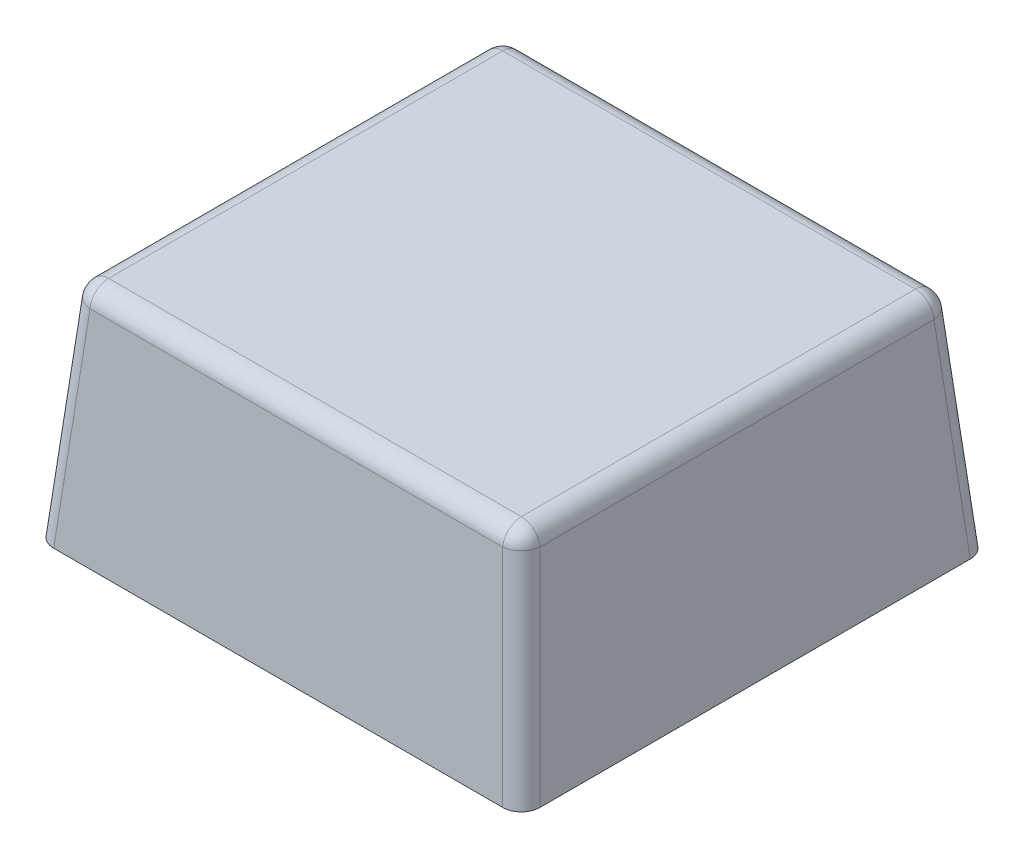
ISO-10303-21;
HEADER;
FILE_DESCRIPTION(('STEP AP214'),'2;1');
FILE_NAME('part.step','',(''),(''),'','','');
FILE_SCHEMA(('AUTOMOTIVE_DESIGN { 1 0 10303 214 1 1 1 1 }'));
ENDSEC;
DATA;
#1=APPLICATION_CONTEXT('core data for automotive mechanical design processes');
#2=APPLICATION_PROTOCOL_DEFINITION('international standard','automotive_design',2000,#1);
#3=PRODUCT_CONTEXT('',#1,'mechanical');
#4=PRODUCT('Part','Part','',(#3));
#5=PRODUCT_RELATED_PRODUCT_CATEGORY('part','',(#4));
#6=PRODUCT_DEFINITION_FORMATION('','',#4);
#7=PRODUCT_DEFINITION_CONTEXT('part definition',#1,'design');
#8=PRODUCT_DEFINITION('design','',#6,#7);
#9=PRODUCT_DEFINITION_SHAPE('','',#8);
#10=(LENGTH_UNIT() NAMED_UNIT(*) SI_UNIT(.MILLI.,.METRE.));
#11=(NAMED_UNIT(*) PLANE_ANGLE_UNIT() SI_UNIT($,.RADIAN.));
#12=(NAMED_UNIT(*) SI_UNIT($,.STERADIAN.) SOLID_ANGLE_UNIT());
#13=UNCERTAINTY_MEASURE_WITH_UNIT(LENGTH_MEASURE(1.E-05),#10,'distance_accuracy_value','');
#14=(GEOMETRIC_REPRESENTATION_CONTEXT(3) GLOBAL_UNCERTAINTY_ASSIGNED_CONTEXT((#13)) GLOBAL_UNIT_ASSIGNED_CONTEXT((#10,
#11,#12)) REPRESENTATION_CONTEXT('',''));
#15=CARTESIAN_POINT('',(0.,0.,0.));
#16=DIRECTION('',(0.,0.,1.));
#17=DIRECTION('',(1.,0.,0.));
#18=AXIS2_PLACEMENT_3D('',#15,#16,#17);
#19=CARTESIAN_POINT('',(0.,0.85,-0.526690243184));
#20=DIRECTION('',(-1.,0.,0.));
#21=DIRECTION('',(0.,0.,1.));
#22=AXIS2_PLACEMENT_3D('',#19,#20,#21);
#23=CYLINDRICAL_SURFACE('',#22,0.05);
#24=CARTESIAN_POINT('',(0.551690243184,0.85,-0.526690243184));
#25=DIRECTION('',(-1.,0.,0.));
#26=DIRECTION('',(0.,0.,-1.));
#27=AXIS2_PLACEMENT_3D('',#24,#25,#26);
#28=CIRCLE('',#27,0.05);
#29=CARTESIAN_POINT('',(0.551690243184,0.9,-0.526690243184));
#30=VERTEX_POINT('',#29);
#31=CARTESIAN_POINT('',(0.551690243184,0.854357787137,-0.576499978088));
#32=VERTEX_POINT('',#31);
#33=EDGE_CURVE('E25',#30,#32,#28,.T.);
#34=ORIENTED_EDGE('',*,*,#33,.T.);
#35=DIRECTION('',(1.,0.,0.));
#36=VECTOR('',#35,1.);
#37=CARTESIAN_POINT('',(0.597506801884,0.854357787137,-0.576499978088));
#38=LINE('',#37,#36);
#39=CARTESIAN_POINT('',(-0.551690243184,0.854357787137,-0.576499978088));
#40=VERTEX_POINT('',#39);
#41=EDGE_CURVE('E166',#40,#32,#38,.T.);
#42=ORIENTED_EDGE('',*,*,#41,.F.);
#43=CARTESIAN_POINT('',(-0.551690243184,0.85,-0.526690243184));
#44=DIRECTION('',(1.,0.,0.));
#45=DIRECTION('',(0.,0.,1.));
#46=AXIS2_PLACEMENT_3D('',#43,#44,#45);
#47=CIRCLE('',#46,0.05);
#48=CARTESIAN_POINT('',(-0.551690243184,0.9,-0.526690243184));
#49=VERTEX_POINT('',#48);
#50=EDGE_CURVE('E11',#40,#49,#47,.T.);
#51=ORIENTED_EDGE('',*,*,#50,.T.);
#52=DIRECTION('',(-1.,0.,0.));
#53=VECTOR('',#52,1.);
#54=CARTESIAN_POINT('',(-0.597506801884,0.9,-0.526690243184));
#55=LINE('',#54,#53);
#56=EDGE_CURVE('E214',#30,#49,#55,.T.);
#57=ORIENTED_EDGE('',*,*,#56,.F.);
#58=EDGE_LOOP('',(#34,#42,#51,#57));
#59=FACE_BOUND('',#58,.T.);
#60=ADVANCED_FACE('F17',(#59),#23,.T.);
#61=CARTESIAN_POINT('',(-0.551690243184,0.85,-0.526690243184));
#62=DIRECTION('',(0.,1.,0.));
#63=DIRECTION('',(1.,0.,0.));
#64=AXIS2_PLACEMENT_3D('',#61,#62,#63);
#65=SPHERICAL_SURFACE('',#64,0.05);
#66=CARTESIAN_POINT('',(-0.551690243184,0.85,-0.526690243184));
#67=DIRECTION('',(0.0868265938642471,0.992432509138969,0.0868265938642274));
#68=DIRECTION('',(0.,-0.0871557427476379,0.996194698091747));
#69=AXIS2_PLACEMENT_3D('',#66,#67,#68);
#70=CIRCLE('',#69,0.05);
#71=CARTESIAN_POINT('',(-0.601499978088,0.854357787137,-0.526690243184));
#72=VERTEX_POINT('',#71);
#73=EDGE_CURVE('E266',#40,#72,#70,.T.);
#74=ORIENTED_EDGE('',*,*,#73,.T.);
#75=CARTESIAN_POINT('',(-0.551690243184,0.85,-0.526690243184));
#76=DIRECTION('',(0.,0.,-1.));
#77=DIRECTION('',(0.,1.,0.));
#78=AXIS2_PLACEMENT_3D('',#75,#76,#77);
#79=CIRCLE('',#78,0.05);
#80=EDGE_CURVE('E153',#72,#49,#79,.T.);
#81=ORIENTED_EDGE('',*,*,#80,.T.);
#82=ORIENTED_EDGE('',*,*,#50,.F.);
#83=EDGE_LOOP('',(#74,#81,#82));
#84=FACE_BOUND('',#83,.T.);
#85=ADVANCED_FACE('F297',(#84),#65,.T.);
#86=CARTESIAN_POINT('',(0.551690243184,0.85,-0.526690243184));
#87=DIRECTION('',(0.,1.,0.));
#88=DIRECTION('',(1.,0.,0.));
#89=AXIS2_PLACEMENT_3D('',#86,#87,#88);
#90=SPHERICAL_SURFACE('',#89,0.05);
#91=CARTESIAN_POINT('',(0.551690243184,0.85,-0.526690243184));
#92=DIRECTION('',(0.,0.,-1.));
#93=DIRECTION('',(-1.,0.,0.));
#94=AXIS2_PLACEMENT_3D('',#91,#92,#93);
#95=CIRCLE('',#94,0.05);
#96=CARTESIAN_POINT('',(0.601499978088,0.854357787137,-0.526690243184));
#97=VERTEX_POINT('',#96);
#98=EDGE_CURVE('E272',#30,#97,#95,.T.);
#99=ORIENTED_EDGE('',*,*,#98,.T.);
#100=CARTESIAN_POINT('',(0.551690243184,0.85,-0.526690243184));
#101=DIRECTION('',(-0.0868265938642471,0.992432509138969,0.0868265938642274));
#102=DIRECTION('',(0.,-0.0871557427476379,0.996194698091747));
#103=AXIS2_PLACEMENT_3D('',#100,#101,#102);
#104=CIRCLE('',#103,0.05);
#105=EDGE_CURVE('E125',#97,#32,#104,.T.);
#106=ORIENTED_EDGE('',*,*,#105,.T.);
#107=ORIENTED_EDGE('',*,*,#33,.F.);
#108=EDGE_LOOP('',(#99,#106,#107));
#109=FACE_BOUND('',#108,.T.);
#110=ADVANCED_FACE('F284',(#109),#90,.T.);
#111=CARTESIAN_POINT('',(-0.591142201832,0.399062049208,-0.566142201832));
#112=DIRECTION('',(-0.0868265938642274,-0.992432509138969,-0.0868265938642471));
#113=DIRECTION('',(0.996194698091747,-0.0871557427476379,0.));
#114=AXIS2_PLACEMENT_3D('',#111,#112,#113);
#115=CYLINDRICAL_SURFACE('',#114,0.05);
#116=CARTESIAN_POINT('',(-0.65,0.3,-0.575190265095));
#117=CARTESIAN_POINT('',(-0.65,0.3,-0.604413846781));
#118=CARTESIAN_POINT('',(-0.629413846781,0.3,-0.625));
#119=CARTESIAN_POINT('',(-0.600190265095,0.3,-0.625));
#120=(BOUNDED_CURVE() B_SPLINE_CURVE(3,(#116,#117,#118,#119),.UNSPECIFIED.,.F.,
.F.) B_SPLINE_CURVE_WITH_KNOTS((4,4),(5.501585242055,7.064785372304),
.UNSPECIFIED.) CURVE() GEOMETRIC_REPRESENTATION_ITEM() RATIONAL_B_SPLINE_CURVE((1.,
0.806524890385,0.806524890385,1.)) REPRESENTATION_ITEM(''));
#121=CARTESIAN_POINT('',(-0.65,0.3,-0.575190265095));
#122=VERTEX_POINT('',#121);
#123=CARTESIAN_POINT('',(-0.600190265095,0.3,-0.625));
#124=VERTEX_POINT('',#123);
#125=EDGE_CURVE('E226',#122,#124,#120,.T.);
#126=ORIENTED_EDGE('',*,*,#125,.F.);
#127=DIRECTION('',(-0.0868265938642471,-0.992432509138967,-0.0868265938642471));
#128=VECTOR('',#127,1.);
#129=CARTESIAN_POINT('',(-0.640951936736,0.403419836345,-0.566142201832));
#130=LINE('',#129,#128);
#131=EDGE_CURVE('E156',#72,#122,#130,.T.);
#132=ORIENTED_EDGE('',*,*,#131,.F.);
#133=ORIENTED_EDGE('',*,*,#73,.F.);
#134=DIRECTION('',(0.0868265938642471,0.992432509138967,0.0868265938642471));
#135=VECTOR('',#134,1.);
#136=CARTESIAN_POINT('',(-0.590765258961,0.407728313066,-0.615574993866));
#137=LINE('',#136,#135);
#138=EDGE_CURVE('E171',#124,#40,#137,.T.);
#139=ORIENTED_EDGE('',*,*,#138,.F.);
#140=EDGE_LOOP('',(#126,#132,#133,#139));
#141=FACE_BOUND('',#140,.T.);
#142=ADVANCED_FACE('F295',(#141),#115,.T.);
#143=CARTESIAN_POINT('',(-0.551690243184,0.85,0.));
#144=DIRECTION('',(0.,0.,1.));
#145=DIRECTION('',(1.,0.,0.));
#146=AXIS2_PLACEMENT_3D('',#143,#144,#145);
#147=CYLINDRICAL_SURFACE('',#146,0.05);
#148=CARTESIAN_POINT('',(-0.551690243184,0.85,0.526690243184));
#149=DIRECTION('',(0.,0.,-1.));
#150=DIRECTION('',(1.,0.,0.));
#151=AXIS2_PLACEMENT_3D('',#148,#149,#150);
#152=CIRCLE('',#151,0.05);
#153=CARTESIAN_POINT('',(-0.601499978088,0.854357787137,0.526690243184));
#154=VERTEX_POINT('',#153);
#155=CARTESIAN_POINT('',(-0.551690243184,0.9,0.526690243184));
#156=VERTEX_POINT('',#155);
#157=EDGE_CURVE('E37',#154,#156,#152,.T.);
#158=ORIENTED_EDGE('',*,*,#157,.T.);
#159=DIRECTION('',(0.,0.,1.));
#160=VECTOR('',#159,1.);
#161=CARTESIAN_POINT('',(-0.551690243184,0.9,0.572506801884));
#162=LINE('',#161,#160);
#163=EDGE_CURVE('E218',#49,#156,#162,.T.);
#164=ORIENTED_EDGE('',*,*,#163,.F.);
#165=ORIENTED_EDGE('',*,*,#80,.F.);
#166=DIRECTION('',(0.,0.,-1.));
#167=VECTOR('',#166,1.);
#168=CARTESIAN_POINT('',(-0.601499978088,0.854357787137,-0.572506801884));
#169=LINE('',#168,#167);
#170=EDGE_CURVE('E145',#154,#72,#169,.T.);
#171=ORIENTED_EDGE('',*,*,#170,.F.);
#172=EDGE_LOOP('',(#158,#164,#165,#171));
#173=FACE_BOUND('',#172,.T.);
#174=ADVANCED_FACE('F152',(#173),#147,.T.);
#175=CARTESIAN_POINT('',(0.551690243184,0.85,0.));
#176=DIRECTION('',(0.,0.,-1.));
#177=DIRECTION('',(-1.,0.,0.));
#178=AXIS2_PLACEMENT_3D('',#175,#176,#177);
#179=CYLINDRICAL_SURFACE('',#178,0.05);
#180=CARTESIAN_POINT('',(0.551690243184,0.85,0.526690243184));
#181=DIRECTION('',(0.,0.,-1.));
#182=DIRECTION('',(0.,-1.,0.));
#183=AXIS2_PLACEMENT_3D('',#180,#181,#182);
#184=CIRCLE('',#183,0.05);
#185=CARTESIAN_POINT('',(0.551690243184,0.9,0.526690243184));
#186=VERTEX_POINT('',#185);
#187=CARTESIAN_POINT('',(0.601499978088,0.854357787137,0.526690243184));
#188=VERTEX_POINT('',#187);
#189=EDGE_CURVE('E126',#186,#188,#184,.T.);
#190=ORIENTED_EDGE('',*,*,#189,.T.);
#191=DIRECTION('',(0.,0.,1.));
#192=VECTOR('',#191,1.);
#193=CARTESIAN_POINT('',(0.601499978088,0.854357787137,0.572506801884));
#194=LINE('',#193,#192);
#195=EDGE_CURVE('E207',#97,#188,#194,.T.);
#196=ORIENTED_EDGE('',*,*,#195,.F.);
#197=ORIENTED_EDGE('',*,*,#98,.F.);
#198=DIRECTION('',(0.,0.,-1.));
#199=VECTOR('',#198,1.);
#200=CARTESIAN_POINT('',(0.551690243184,0.9,-0.572506801884));
#201=LINE('',#200,#199);
#202=EDGE_CURVE('E164',#186,#30,#201,.T.);
#203=ORIENTED_EDGE('',*,*,#202,.F.);
#204=EDGE_LOOP('',(#190,#196,#197,#203));
#205=FACE_BOUND('',#204,.T.);
#206=ADVANCED_FACE('F458',(#205),#179,.T.);
#207=CARTESIAN_POINT('',(0.600565773584,0.291350131197,-0.575565773584));
#208=DIRECTION('',(0.0868265938642471,-0.992432509138969,-0.0868265938642274));
#209=DIRECTION('',(0.,0.0871557427476379,-0.996194698091747));
#210=AXIS2_PLACEMENT_3D('',#207,#208,#209);
#211=CYLINDRICAL_SURFACE('',#210,0.05);
#212=CARTESIAN_POINT('',(0.600190265095,0.3,-0.625));
#213=CARTESIAN_POINT('',(0.629413846781,0.3,-0.625));
#214=CARTESIAN_POINT('',(0.65,0.3,-0.604413846781));
#215=CARTESIAN_POINT('',(0.65,0.3,-0.575190265095));
#216=(BOUNDED_CURVE() B_SPLINE_CURVE(3,(#212,#213,#214,#215),.UNSPECIFIED.,.F.,
.F.) B_SPLINE_CURVE_WITH_KNOTS((4,4),(5.501585242055,7.064785372304),
.UNSPECIFIED.) CURVE() GEOMETRIC_REPRESENTATION_ITEM() RATIONAL_B_SPLINE_CURVE((1.,
0.806524890385,0.806524890385,1.)) REPRESENTATION_ITEM(''));
#217=CARTESIAN_POINT('',(0.600190265095,0.3,-0.625));
#218=VERTEX_POINT('',#217);
#219=CARTESIAN_POINT('',(0.65,0.3,-0.575190265095));
#220=VERTEX_POINT('',#219);
#221=EDGE_CURVE('E231',#218,#220,#216,.T.);
#222=ORIENTED_EDGE('',*,*,#221,.F.);
#223=DIRECTION('',(0.0868265938642471,-0.992432509138967,-0.0868265938642471));
#224=VECTOR('',#223,1.);
#225=CARTESIAN_POINT('',(0.600565773584,0.295707918334,-0.625375508489));
#226=LINE('',#225,#224);
#227=EDGE_CURVE('E170',#32,#218,#226,.T.);
#228=ORIENTED_EDGE('',*,*,#227,.F.);
#229=ORIENTED_EDGE('',*,*,#105,.F.);
#230=DIRECTION('',(-0.0868265938642471,0.992432509138967,0.0868265938642471));
#231=VECTOR('',#230,1.);
#232=CARTESIAN_POINT('',(0.640951936736,0.403419836345,-0.566142201832));
#233=LINE('',#232,#231);
#234=EDGE_CURVE('E195',#220,#97,#233,.T.);
#235=ORIENTED_EDGE('',*,*,#234,.F.);
#236=EDGE_LOOP('',(#222,#228,#229,#235));
#237=FACE_BOUND('',#236,.T.);
#238=ADVANCED_FACE('F288',(#237),#211,.T.);
#239=CARTESIAN_POINT('',(-0.551690243184,0.85,0.526690243184));
#240=DIRECTION('',(0.,1.,0.));
#241=DIRECTION('',(1.,0.,0.));
#242=AXIS2_PLACEMENT_3D('',#239,#240,#241);
#243=SPHERICAL_SURFACE('',#242,0.05);
#244=CARTESIAN_POINT('',(-0.551690243184,0.85,0.526690243184));
#245=DIRECTION('',(0.0868265938642471,0.992432509138969,-0.0868265938642274));
#246=DIRECTION('',(0.,0.0871557427476379,0.996194698091747));
#247=AXIS2_PLACEMENT_3D('',#244,#245,#246);
#248=CIRCLE('',#247,0.05);
#249=CARTESIAN_POINT('',(-0.551690243184,0.854357787137,0.576499978088));
#250=VERTEX_POINT('',#249);
#251=EDGE_CURVE('E120',#154,#250,#248,.T.);
#252=ORIENTED_EDGE('',*,*,#251,.T.);
#253=CARTESIAN_POINT('',(-0.551690243184,0.85,0.526690243184));
#254=DIRECTION('',(-1.,0.,0.));
#255=DIRECTION('',(0.,0.,1.));
#256=AXIS2_PLACEMENT_3D('',#253,#254,#255);
#257=CIRCLE('',#256,0.05);
#258=EDGE_CURVE('E122',#250,#156,#257,.T.);
#259=ORIENTED_EDGE('',*,*,#258,.T.);
#260=ORIENTED_EDGE('',*,*,#157,.F.);
#261=EDGE_LOOP('',(#252,#259,#260));
#262=FACE_BOUND('',#261,.T.);
#263=ADVANCED_FACE('F119',(#262),#243,.T.);
#264=CARTESIAN_POINT('',(0.551690243184,0.85,0.526690243184));
#265=DIRECTION('',(0.,1.,0.));
#266=DIRECTION('',(1.,0.,0.));
#267=AXIS2_PLACEMENT_3D('',#264,#265,#266);
#268=SPHERICAL_SURFACE('',#267,0.05);
#269=CARTESIAN_POINT('',(0.551690243184,0.85,0.526690243184));
#270=DIRECTION('',(1.,0.,0.));
#271=DIRECTION('',(0.,0.,-1.));
#272=AXIS2_PLACEMENT_3D('',#269,#270,#271);
#273=CIRCLE('',#272,0.05);
#274=CARTESIAN_POINT('',(0.551690243184,0.854357787137,0.576499978088));
#275=VERTEX_POINT('',#274);
#276=EDGE_CURVE('E139',#186,#275,#273,.T.);
#277=ORIENTED_EDGE('',*,*,#276,.T.);
#278=CARTESIAN_POINT('',(0.551690243184,0.85,0.526690243184));
#279=DIRECTION('',(-0.0868265938642471,0.992432509138969,-0.0868265938642274));
#280=DIRECTION('',(0.,0.0871557427476379,0.996194698091747));
#281=AXIS2_PLACEMENT_3D('',#278,#279,#280);
#282=CIRCLE('',#281,0.05);
#283=EDGE_CURVE('E255',#275,#188,#282,.T.);
#284=ORIENTED_EDGE('',*,*,#283,.T.);
#285=ORIENTED_EDGE('',*,*,#189,.F.);
#286=EDGE_LOOP('',(#277,#284,#285));
#287=FACE_BOUND('',#286,.T.);
#288=ADVANCED_FACE('F506',(#287),#268,.T.);
#289=CARTESIAN_POINT('',(-0.590765258961,0.403370525928,0.565765258961));
#290=DIRECTION('',(-0.0868265938642471,-0.992432509138969,0.0868265938642274));
#291=DIRECTION('',(0.,-0.0871557427476379,-0.996194698091747));
#292=AXIS2_PLACEMENT_3D('',#289,#290,#291);
#293=CYLINDRICAL_SURFACE('',#292,0.05);
#294=CARTESIAN_POINT('',(-0.600190265095,0.3,0.625));
#295=CARTESIAN_POINT('',(-0.629413846781,0.3,0.625));
#296=CARTESIAN_POINT('',(-0.65,0.3,0.604413846781));
#297=CARTESIAN_POINT('',(-0.65,0.3,0.575190265095));
#298=(BOUNDED_CURVE() B_SPLINE_CURVE(3,(#294,#295,#296,#297),.UNSPECIFIED.,.F.,
.F.) B_SPLINE_CURVE_WITH_KNOTS((4,4),(5.501585242055,7.064785372304),
.UNSPECIFIED.) CURVE() GEOMETRIC_REPRESENTATION_ITEM() RATIONAL_B_SPLINE_CURVE((1.,
0.806524890385,0.806524890385,1.)) REPRESENTATION_ITEM(''));
#299=CARTESIAN_POINT('',(-0.600190265095,0.3,0.625));
#300=VERTEX_POINT('',#299);
#301=CARTESIAN_POINT('',(-0.65,0.3,0.575190265095));
#302=VERTEX_POINT('',#301);
#303=EDGE_CURVE('E247',#300,#302,#298,.T.);
#304=ORIENTED_EDGE('',*,*,#303,.F.);
#305=DIRECTION('',(-0.0868265938642471,-0.992432509138967,0.0868265938642471));
#306=VECTOR('',#305,1.);
#307=CARTESIAN_POINT('',(-0.590765258961,0.407728313066,0.615574993866));
#308=LINE('',#307,#306);
#309=EDGE_CURVE('E136',#250,#300,#308,.T.);
#310=ORIENTED_EDGE('',*,*,#309,.F.);
#311=ORIENTED_EDGE('',*,*,#251,.F.);
#312=DIRECTION('',(0.0868265938642471,0.992432509138967,-0.0868265938642471));
#313=VECTOR('',#312,1.);
#314=CARTESIAN_POINT('',(-0.650375508489,0.295707918334,0.575565773584));
#315=LINE('',#314,#313);
#316=EDGE_CURVE('E133',#302,#154,#315,.T.);
#317=ORIENTED_EDGE('',*,*,#316,.F.);
#318=EDGE_LOOP('',(#304,#310,#311,#317));
#319=FACE_BOUND('',#318,.T.);
#320=ADVANCED_FACE('F132',(#319),#293,.T.);
#321=CARTESIAN_POINT('',(0.,0.85,0.526690243184));
#322=DIRECTION('',(1.,0.,0.));
#323=DIRECTION('',(0.,0.,-1.));
#324=AXIS2_PLACEMENT_3D('',#321,#322,#323);
#325=CYLINDRICAL_SURFACE('',#324,0.05);
#326=ORIENTED_EDGE('',*,*,#258,.F.);
#327=DIRECTION('',(-1.,0.,0.));
#328=VECTOR('',#327,1.);
#329=CARTESIAN_POINT('',(-0.597506801884,0.854357787137,0.576499978088));
#330=LINE('',#329,#328);
#331=EDGE_CURVE('E149',#275,#250,#330,.T.);
#332=ORIENTED_EDGE('',*,*,#331,.F.);
#333=ORIENTED_EDGE('',*,*,#276,.F.);
#334=DIRECTION('',(1.,0.,0.));
#335=VECTOR('',#334,1.);
#336=CARTESIAN_POINT('',(0.597506801884,0.9,0.526690243184));
#337=LINE('',#336,#335);
#338=EDGE_CURVE('E222',#156,#186,#337,.T.);
#339=ORIENTED_EDGE('',*,*,#338,.F.);
#340=EDGE_LOOP('',(#326,#332,#333,#339));
#341=FACE_BOUND('',#340,.T.);
#342=ADVANCED_FACE('F412',(#341),#325,.T.);
#343=CARTESIAN_POINT('',(0.600565773584,0.291350131197,0.575565773584));
#344=DIRECTION('',(0.0868265938642274,-0.992432509138969,0.0868265938642471));
#345=DIRECTION('',(0.996194698091747,0.0871557427476379,0.));
#346=AXIS2_PLACEMENT_3D('',#343,#344,#345);
#347=CYLINDRICAL_SURFACE('',#346,0.05);
#348=CARTESIAN_POINT('',(0.65,0.3,0.575190265095));
#349=CARTESIAN_POINT('',(0.65,0.3,0.604413846781));
#350=CARTESIAN_POINT('',(0.629413846781,0.3,0.625));
#351=CARTESIAN_POINT('',(0.600190265095,0.3,0.625));
#352=(BOUNDED_CURVE() B_SPLINE_CURVE(3,(#348,#349,#350,#351),.UNSPECIFIED.,.F.,
.F.) B_SPLINE_CURVE_WITH_KNOTS((4,4),(5.501585242055,7.064785372304),
.UNSPECIFIED.) CURVE() GEOMETRIC_REPRESENTATION_ITEM() RATIONAL_B_SPLINE_CURVE((1.,
0.806524890385,0.806524890385,1.)) REPRESENTATION_ITEM(''));
#353=CARTESIAN_POINT('',(0.65,0.3,0.575190265095));
#354=VERTEX_POINT('',#353);
#355=CARTESIAN_POINT('',(0.600190265095,0.3,0.625));
#356=VERTEX_POINT('',#355);
#357=EDGE_CURVE('E239',#354,#356,#352,.T.);
#358=ORIENTED_EDGE('',*,*,#357,.F.);
#359=DIRECTION('',(0.0868265938642471,-0.992432509138967,0.0868265938642471));
#360=VECTOR('',#359,1.);
#361=CARTESIAN_POINT('',(0.650375508489,0.295707918334,0.575565773584));
#362=LINE('',#361,#360);
#363=EDGE_CURVE('E203',#188,#354,#362,.T.);
#364=ORIENTED_EDGE('',*,*,#363,.F.);
#365=ORIENTED_EDGE('',*,*,#283,.F.);
#366=DIRECTION('',(-0.0868265938642471,0.992432509138967,-0.0868265938642471));
#367=VECTOR('',#366,1.);
#368=CARTESIAN_POINT('',(0.600565773584,0.295707918334,0.625375508489));
#369=LINE('',#368,#367);
#370=EDGE_CURVE('E187',#356,#275,#369,.T.);
#371=ORIENTED_EDGE('',*,*,#370,.F.);
#372=EDGE_LOOP('',(#358,#364,#365,#371));
#373=FACE_BOUND('',#372,.T.);
#374=ADVANCED_FACE('F417',(#373),#347,.T.);
#375=CARTESIAN_POINT('',(0.,0.3,0.));
#376=DIRECTION('',(0.,1.,0.));
#377=DIRECTION('',(1.,0.,0.));
#378=AXIS2_PLACEMENT_3D('',#375,#376,#377);
#379=PLANE('',#378);
#380=DIRECTION('',(0.,0.,1.));
#381=VECTOR('',#380,1.);
#382=CARTESIAN_POINT('',(-0.65,0.3,0.625));
#383=LINE('',#382,#381);
#384=EDGE_CURVE('E147',#122,#302,#383,.T.);
#385=ORIENTED_EDGE('',*,*,#384,.F.);
#386=ORIENTED_EDGE('',*,*,#125,.T.);
#387=DIRECTION('',(-1.,0.,0.));
#388=VECTOR('',#387,1.);
#389=CARTESIAN_POINT('',(0.65,0.3,-0.625));
#390=LINE('',#389,#388);
#391=EDGE_CURVE('E199',#218,#124,#390,.T.);
#392=ORIENTED_EDGE('',*,*,#391,.F.);
#393=ORIENTED_EDGE('',*,*,#221,.T.);
#394=DIRECTION('',(0.,0.,-1.));
#395=VECTOR('',#394,1.);
#396=CARTESIAN_POINT('',(0.65,0.3,0.625));
#397=LINE('',#396,#395);
#398=EDGE_CURVE('E191',#354,#220,#397,.T.);
#399=ORIENTED_EDGE('',*,*,#398,.F.);
#400=ORIENTED_EDGE('',*,*,#357,.T.);
#401=DIRECTION('',(1.,0.,0.));
#402=VECTOR('',#401,1.);
#403=CARTESIAN_POINT('',(0.65,0.3,0.625));
#404=LINE('',#403,#402);
#405=EDGE_CURVE('E180',#300,#356,#404,.T.);
#406=ORIENTED_EDGE('',*,*,#405,.F.);
#407=ORIENTED_EDGE('',*,*,#303,.T.);
#408=EDGE_LOOP('',(#385,#386,#392,#393,#399,#400,#406,#407));
#409=FACE_BOUND('',#408,.T.);
#410=ADVANCED_FACE('F478',(#409),#379,.F.);
#411=CARTESIAN_POINT('',(0.,0.9,0.));
#412=DIRECTION('',(0.,1.,0.));
#413=DIRECTION('',(1.,0.,0.));
#414=AXIS2_PLACEMENT_3D('',#411,#412,#413);
#415=PLANE('',#414);
#416=ORIENTED_EDGE('',*,*,#202,.T.);
#417=ORIENTED_EDGE('',*,*,#56,.T.);
#418=ORIENTED_EDGE('',*,*,#163,.T.);
#419=ORIENTED_EDGE('',*,*,#338,.T.);
#420=EDGE_LOOP('',(#416,#417,#418,#419));
#421=FACE_BOUND('',#420,.T.);
#422=ADVANCED_FACE('F299',(#421),#415,.T.);
#423=CARTESIAN_POINT('',(0.65,0.3,-0.625));
#424=DIRECTION('',(0.,0.0871557427476379,-0.996194698091747));
#425=DIRECTION('',(-1.,0.,0.));
#426=AXIS2_PLACEMENT_3D('',#423,#424,#425);
#427=PLANE('',#426);
#428=ORIENTED_EDGE('',*,*,#391,.T.);
#429=ORIENTED_EDGE('',*,*,#138,.T.);
#430=ORIENTED_EDGE('',*,*,#41,.T.);
#431=ORIENTED_EDGE('',*,*,#227,.T.);
#432=EDGE_LOOP('',(#428,#429,#430,#431));
#433=FACE_BOUND('',#432,.T.);
#434=ADVANCED_FACE('F291',(#433),#427,.T.);
#435=CARTESIAN_POINT('',(0.65,0.3,0.625));
#436=DIRECTION('',(0.996194698091747,0.0871557427476379,0.));
#437=DIRECTION('',(0.,0.,-1.));
#438=AXIS2_PLACEMENT_3D('',#435,#436,#437);
#439=PLANE('',#438);
#440=ORIENTED_EDGE('',*,*,#398,.T.);
#441=ORIENTED_EDGE('',*,*,#234,.T.);
#442=ORIENTED_EDGE('',*,*,#195,.T.);
#443=ORIENTED_EDGE('',*,*,#363,.T.);
#444=EDGE_LOOP('',(#440,#441,#442,#443));
#445=FACE_BOUND('',#444,.T.);
#446=ADVANCED_FACE('F435',(#445),#439,.T.);
#447=CARTESIAN_POINT('',(0.65,0.3,0.625));
#448=DIRECTION('',(0.,0.0871557427476379,0.996194698091747));
#449=DIRECTION('',(1.,0.,0.));
#450=AXIS2_PLACEMENT_3D('',#447,#448,#449);
#451=PLANE('',#450);
#452=ORIENTED_EDGE('',*,*,#331,.T.);
#453=ORIENTED_EDGE('',*,*,#309,.T.);
#454=ORIENTED_EDGE('',*,*,#405,.T.);
#455=ORIENTED_EDGE('',*,*,#370,.T.);
#456=EDGE_LOOP('',(#452,#453,#454,#455));
#457=FACE_BOUND('',#456,.T.);
#458=ADVANCED_FACE('F427',(#457),#451,.T.);
#459=CARTESIAN_POINT('',(-0.65,0.3,0.625));
#460=DIRECTION('',(-0.996194698091747,0.0871557427476379,0.));
#461=DIRECTION('',(0.,0.,1.));
#462=AXIS2_PLACEMENT_3D('',#459,#460,#461);
#463=PLANE('',#462);
#464=ORIENTED_EDGE('',*,*,#170,.T.);
#465=ORIENTED_EDGE('',*,*,#131,.T.);
#466=ORIENTED_EDGE('',*,*,#384,.T.);
#467=ORIENTED_EDGE('',*,*,#316,.T.);
#468=EDGE_LOOP('',(#464,#465,#466,#467));
#469=FACE_BOUND('',#468,.T.);
#470=ADVANCED_FACE('F143',(#469),#463,.T.);
#471=CLOSED_SHELL('',(#60,#85,#110,#142,#174,#206,#238,#263,#288,#320,#342,#374,#410,#422,#434,
#446,#458,#470));
#472=MANIFOLD_SOLID_BREP('B1',#471);
#473=ADVANCED_BREP_SHAPE_REPRESENTATION('',(#18,#472),#14);
#474=SHAPE_DEFINITION_REPRESENTATION(#9,#473);
ENDSEC;
END-ISO-10303-21;
